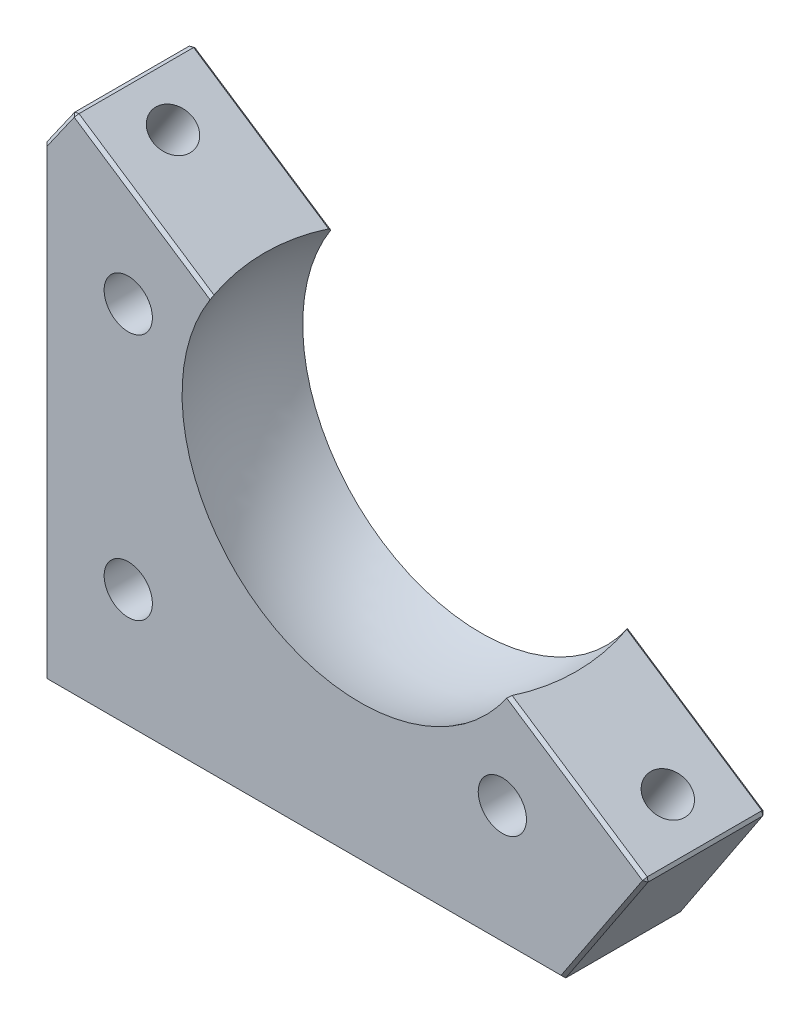
ISO-10303-21;
HEADER;
FILE_DESCRIPTION(('STEP AP214'),'2;1');
FILE_NAME('part.step','',(''),(''),'','','');
FILE_SCHEMA(('AUTOMOTIVE_DESIGN { 1 0 10303 214 1 1 1 1 }'));
ENDSEC;
DATA;
#1=APPLICATION_CONTEXT('core data for automotive mechanical design processes');
#2=APPLICATION_PROTOCOL_DEFINITION('international standard','automotive_design',2000,#1);
#3=PRODUCT_CONTEXT('',#1,'mechanical');
#4=PRODUCT('Part','Part','',(#3));
#5=PRODUCT_RELATED_PRODUCT_CATEGORY('part','',(#4));
#6=PRODUCT_DEFINITION_FORMATION('','',#4);
#7=PRODUCT_DEFINITION_CONTEXT('part definition',#1,'design');
#8=PRODUCT_DEFINITION('design','',#6,#7);
#9=PRODUCT_DEFINITION_SHAPE('','',#8);
#10=(LENGTH_UNIT() NAMED_UNIT(*) SI_UNIT(.MILLI.,.METRE.));
#11=(NAMED_UNIT(*) PLANE_ANGLE_UNIT() SI_UNIT($,.RADIAN.));
#12=(NAMED_UNIT(*) SI_UNIT($,.STERADIAN.) SOLID_ANGLE_UNIT());
#13=UNCERTAINTY_MEASURE_WITH_UNIT(LENGTH_MEASURE(1.E-05),#10,'distance_accuracy_value','');
#14=(GEOMETRIC_REPRESENTATION_CONTEXT(3) GLOBAL_UNCERTAINTY_ASSIGNED_CONTEXT((#13)) GLOBAL_UNIT_ASSIGNED_CONTEXT((#10,
#11,#12)) REPRESENTATION_CONTEXT('',''));
#15=CARTESIAN_POINT('',(0.,0.,0.));
#16=DIRECTION('',(0.,0.,1.));
#17=DIRECTION('',(1.,0.,0.));
#18=AXIS2_PLACEMENT_3D('',#15,#16,#17);
#19=CARTESIAN_POINT('',(4.91424723113366,84.,20.));
#20=DIRECTION('',(-0.552631578947369,-0.833425664321743,0.));
#21=DIRECTION('',(0.833425664321743,-0.552631578947369,0.));
#22=AXIS2_PLACEMENT_3D('',#19,#20,#21);
#23=PLANE('',#22);
#24=DIRECTION('',(0.,0.,1.));
#25=VECTOR('',#24,1.);
#26=CARTESIAN_POINT('',(5.33096006329454,83.7236842105263,20.));
#27=LINE('',#26,#25);
#28=CARTESIAN_POINT('',(5.33096006329454,83.7236842105263,0.5));
#29=VERTEX_POINT('',#28);
#30=CARTESIAN_POINT('',(5.33096006329454,83.7236842105263,19.5));
#31=VERTEX_POINT('',#30);
#32=EDGE_CURVE('E199',#29,#31,#27,.T.);
#33=ORIENTED_EDGE('',*,*,#32,.T.);
#34=DIRECTION('',(0.833425664321743,-0.552631578947369,0.));
#35=VECTOR('',#34,1.);
#36=CARTESIAN_POINT('',(27.8334529999816,68.8026315789474,19.5));
#37=LINE('',#36,#35);
#38=CARTESIAN_POINT('',(27.7090438574282,68.8851253439321,19.5));
#39=VERTEX_POINT('',#38);
#40=EDGE_CURVE('E206',#31,#39,#37,.T.);
#41=ORIENTED_EDGE('',*,*,#40,.T.);
#42=CARTESIAN_POINT('',(54.9892392291317,50.796052631579,10.));
#43=DIRECTION('',(-0.552631578947369,-0.833425664321743,0.));
#44=DIRECTION('',(0.833425664321743,-0.552631578947369,0.));
#45=AXIS2_PLACEMENT_3D('',#42,#43,#44);
#46=CIRCLE('',#45,34.0833333333333);
#47=CARTESIAN_POINT('',(27.7090438574282,68.8851253439321,0.499999999999993));
#48=VERTEX_POINT('',#47);
#49=EDGE_CURVE('E401',#48,#39,#46,.F.);
#50=ORIENTED_EDGE('',*,*,#49,.F.);
#51=DIRECTION('',(-0.833425664321743,0.552631578947369,0.));
#52=VECTOR('',#51,1.);
#53=CARTESIAN_POINT('',(4.91424723113366,84.,0.5));
#54=LINE('',#53,#52);
#55=EDGE_CURVE('E196',#48,#29,#54,.T.);
#56=ORIENTED_EDGE('',*,*,#55,.T.);
#57=EDGE_LOOP('',(#33,#41,#50,#56));
#58=FACE_BOUND('',#57,.T.);
#59=CARTESIAN_POINT('',(11.4149674128433,79.6894736842105,10.));
#60=DIRECTION('',(0.552631578947369,0.833425664321743,0.));
#61=DIRECTION('',(-0.833425664321743,0.552631578947369,0.));
#62=AXIS2_PLACEMENT_3D('',#59,#60,#61);
#63=CIRCLE('',#62,3.4);
#64=CARTESIAN_POINT('',(8.58132015414933,81.5684210526316,10.));
#65=VERTEX_POINT('',#64);
#66=EDGE_CURVE('E397',#65,#65,#63,.T.);
#67=ORIENTED_EDGE('',*,*,#66,.F.);
#68=EDGE_LOOP('',(#67));
#69=FACE_BOUND('',#68,.T.);
#70=ADVANCED_FACE('F48',(#58,#69),#23,.F.);
#71=CARTESIAN_POINT('',(77.0055671949644,36.1973684210526,20.));
#72=DIRECTION('',(-0.552631578947368,-0.833425664321743,0.));
#73=DIRECTION('',(0.833425664321743,-0.552631578947368,0.));
#74=AXIS2_PLACEMENT_3D('',#71,#72,#73);
#75=PLANE('',#74);
#76=CARTESIAN_POINT('',(93.4240527821027,25.3105263157894,10.));
#77=DIRECTION('',(0.552631578947368,0.833425664321743,0.));
#78=DIRECTION('',(-0.833425664321743,0.552631578947368,0.));
#79=AXIS2_PLACEMENT_3D('',#76,#77,#78);
#80=CIRCLE('',#79,3.39999999999999);
#81=CARTESIAN_POINT('',(90.5904055234088,27.1894736842105,10.));
#82=VERTEX_POINT('',#81);
#83=EDGE_CURVE('E391',#82,#82,#80,.T.);
#84=ORIENTED_EDGE('',*,*,#83,.F.);
#85=EDGE_LOOP('',(#84));
#86=FACE_BOUND('',#85,.T.);
#87=CARTESIAN_POINT('',(49.8497809658143,54.203947368421,10.));
#88=DIRECTION('',(-0.552631578947368,-0.833425664321743,0.));
#89=DIRECTION('',(0.833425664321743,-0.552631578947368,0.));
#90=AXIS2_PLACEMENT_3D('',#87,#88,#89);
#91=CIRCLE('',#90,34.0833333333333);
#92=CARTESIAN_POINT('',(77.1299763375178,36.1148746560679,19.5));
#93=VERTEX_POINT('',#92);
#94=CARTESIAN_POINT('',(77.1299763375178,36.1148746560679,0.500000000000013));
#95=VERTEX_POINT('',#94);
#96=EDGE_CURVE('E404',#93,#95,#91,.F.);
#97=ORIENTED_EDGE('',*,*,#96,.F.);
#98=DIRECTION('',(0.833425664321743,-0.552631578947368,0.));
#99=VECTOR('',#98,1.);
#100=CARTESIAN_POINT('',(99.9247729638123,21.,19.5));
#101=LINE('',#100,#99);
#102=CARTESIAN_POINT('',(99.5080601316515,21.2763157894737,19.5));
#103=VERTEX_POINT('',#102);
#104=EDGE_CURVE('E460',#93,#103,#101,.T.);
#105=ORIENTED_EDGE('',*,*,#104,.T.);
#106=DIRECTION('',(0.,0.,-1.));
#107=VECTOR('',#106,1.);
#108=CARTESIAN_POINT('',(99.5080601316515,21.2763157894737,20.));
#109=LINE('',#108,#107);
#110=CARTESIAN_POINT('',(99.5080601316515,21.2763157894737,0.5));
#111=VERTEX_POINT('',#110);
#112=EDGE_CURVE('E467',#103,#111,#109,.T.);
#113=ORIENTED_EDGE('',*,*,#112,.T.);
#114=DIRECTION('',(-0.833425664321743,0.552631578947368,0.));
#115=VECTOR('',#114,1.);
#116=CARTESIAN_POINT('',(77.0055671949644,36.1973684210526,0.5));
#117=LINE('',#116,#115);
#118=EDGE_CURVE('E466',#111,#95,#117,.T.);
#119=ORIENTED_EDGE('',*,*,#118,.T.);
#120=EDGE_LOOP('',(#97,#105,#113,#119));
#121=FACE_BOUND('',#120,.T.);
#122=ADVANCED_FACE('F252',(#86,#121),#75,.F.);
#123=CARTESIAN_POINT('',(86.,0.,20.));
#124=DIRECTION('',(0.,1.,0.));
#125=DIRECTION('',(-1.,0.,0.));
#126=AXIS2_PLACEMENT_3D('',#123,#124,#125);
#127=PLANE('',#126);
#128=CARTESIAN_POINT('',(76.6410369467711,0.,10.));
#129=DIRECTION('',(0.,1.,0.));
#130=DIRECTION('',(1.,0.,0.));
#131=AXIS2_PLACEMENT_3D('',#128,#129,#130);
#132=ELLIPSE('',#131,4.07954799756133,3.39999999999999);
#133=CARTESIAN_POINT('',(80.7205849443324,0.,10.));
#134=VERTEX_POINT('',#133);
#135=EDGE_CURVE('E396',#134,#134,#132,.T.);
#136=ORIENTED_EDGE('',*,*,#135,.T.);
#137=EDGE_LOOP('',(#136));
#138=FACE_BOUND('',#137,.T.);
#139=DIRECTION('',(0.,0.,-1.));
#140=VECTOR('',#139,1.);
#141=CARTESIAN_POINT('',(86.,0.,20.));
#142=LINE('',#141,#140);
#143=CARTESIAN_POINT('',(86.,0.,19.5));
#144=VERTEX_POINT('',#143);
#145=CARTESIAN_POINT('',(86.,0.,0.5));
#146=VERTEX_POINT('',#145);
#147=EDGE_CURVE('E179',#144,#146,#142,.T.);
#148=ORIENTED_EDGE('',*,*,#147,.F.);
#149=DIRECTION('',(-1.,0.,0.));
#150=VECTOR('',#149,1.);
#151=CARTESIAN_POINT('',(0.,0.,19.5));
#152=LINE('',#151,#150);
#153=CARTESIAN_POINT('',(0.5,0.,19.5));
#154=VERTEX_POINT('',#153);
#155=EDGE_CURVE('E481',#144,#154,#152,.T.);
#156=ORIENTED_EDGE('',*,*,#155,.T.);
#157=DIRECTION('',(0.,0.,-1.));
#158=VECTOR('',#157,1.);
#159=CARTESIAN_POINT('',(0.5,0.,20.));
#160=LINE('',#159,#158);
#161=CARTESIAN_POINT('',(0.5,0.,0.5));
#162=VERTEX_POINT('',#161);
#163=EDGE_CURVE('E479',#154,#162,#160,.T.);
#164=ORIENTED_EDGE('',*,*,#163,.T.);
#165=DIRECTION('',(1.,0.,0.));
#166=VECTOR('',#165,1.);
#167=CARTESIAN_POINT('',(86.,0.,0.5));
#168=LINE('',#167,#166);
#169=EDGE_CURVE('E477',#162,#146,#168,.T.);
#170=ORIENTED_EDGE('',*,*,#169,.T.);
#171=EDGE_LOOP('',(#148,#156,#164,#170));
#172=FACE_BOUND('',#171,.T.);
#173=ADVANCED_FACE('F258',(#138,#172),#127,.F.);
#174=CARTESIAN_POINT('',(99.9247729638123,21.,20.));
#175=DIRECTION('',(-0.833425664321742,0.552631578947369,0.));
#176=DIRECTION('',(-0.552631578947369,-0.833425664321742,0.));
#177=AXIS2_PLACEMENT_3D('',#174,#175,#176);
#178=PLANE('',#177);
#179=DIRECTION('',(0.,0.,1.));
#180=VECTOR('',#179,1.);
#181=CARTESIAN_POINT('',(99.6484571743387,20.5832871678391,20.));
#182=LINE('',#181,#180);
#183=CARTESIAN_POINT('',(99.6484571743387,20.5832871678391,0.5));
#184=VERTEX_POINT('',#183);
#185=CARTESIAN_POINT('',(99.6484571743387,20.5832871678391,19.5));
#186=VERTEX_POINT('',#185);
#187=EDGE_CURVE('E472',#184,#186,#182,.T.);
#188=ORIENTED_EDGE('',*,*,#187,.T.);
#189=DIRECTION('',(-0.552631578947369,-0.833425664321742,0.));
#190=VECTOR('',#189,1.);
#191=CARTESIAN_POINT('',(86.,0.,19.5));
#192=LINE('',#191,#190);
#193=EDGE_CURVE('E468',#186,#144,#192,.T.);
#194=ORIENTED_EDGE('',*,*,#193,.T.);
#195=ORIENTED_EDGE('',*,*,#147,.T.);
#196=DIRECTION('',(0.552631578947369,0.833425664321742,0.));
#197=VECTOR('',#196,1.);
#198=CARTESIAN_POINT('',(99.9247729638123,21.,0.5));
#199=LINE('',#198,#197);
#200=EDGE_CURVE('E523',#146,#184,#199,.T.);
#201=ORIENTED_EDGE('',*,*,#200,.T.);
#202=EDGE_LOOP('',(#188,#194,#195,#201));
#203=FACE_BOUND('',#202,.T.);
#204=ADVANCED_FACE('F265',(#203),#178,.F.);
#205=CARTESIAN_POINT('',(0.,77.,20.));
#206=DIRECTION('',(0.818448565329253,-0.574579799427798,0.));
#207=DIRECTION('',(0.574579799427798,0.818448565329253,0.));
#208=AXIS2_PLACEMENT_3D('',#205,#206,#207);
#209=PLANE('',#208);
#210=DIRECTION('',(0.,0.,-1.));
#211=VECTOR('',#210,1.);
#212=CARTESIAN_POINT('',(0.,77.,20.));
#213=LINE('',#212,#211);
#214=CARTESIAN_POINT('',(0.,77.,19.5));
#215=VERTEX_POINT('',#214);
#216=CARTESIAN_POINT('',(0.,77.,0.5));
#217=VERTEX_POINT('',#216);
#218=EDGE_CURVE('E167',#215,#217,#213,.T.);
#219=ORIENTED_EDGE('',*,*,#218,.F.);
#220=DIRECTION('',(0.574579799427798,0.818448565329253,0.));
#221=VECTOR('',#220,1.);
#222=CARTESIAN_POINT('',(4.91424723113366,84.,19.5));
#223=LINE('',#222,#221);
#224=CARTESIAN_POINT('',(4.61900891149117,83.5794537514506,19.5));
#225=VERTEX_POINT('',#224);
#226=EDGE_CURVE('E175',#215,#225,#223,.T.);
#227=ORIENTED_EDGE('',*,*,#226,.T.);
#228=DIRECTION('',(0.,0.,-1.));
#229=VECTOR('',#228,1.);
#230=CARTESIAN_POINT('',(4.61900891149117,83.5794537514506,20.));
#231=LINE('',#230,#229);
#232=CARTESIAN_POINT('',(4.61900891149117,83.5794537514506,0.5));
#233=VERTEX_POINT('',#232);
#234=EDGE_CURVE('E197',#225,#233,#231,.T.);
#235=ORIENTED_EDGE('',*,*,#234,.T.);
#236=DIRECTION('',(-0.574579799427798,-0.818448565329253,0.));
#237=VECTOR('',#236,1.);
#238=CARTESIAN_POINT('',(0.,77.,0.5));
#239=LINE('',#238,#237);
#240=EDGE_CURVE('E178',#233,#217,#239,.T.);
#241=ORIENTED_EDGE('',*,*,#240,.T.);
#242=EDGE_LOOP('',(#219,#227,#235,#241));
#243=FACE_BOUND('',#242,.T.);
#244=ADVANCED_FACE('F172',(#243),#209,.F.);
#245=CARTESIAN_POINT('',(0.,0.,20.));
#246=DIRECTION('',(1.,0.,0.));
#247=DIRECTION('',(0.,0.,-1.));
#248=AXIS2_PLACEMENT_3D('',#245,#246,#247);
#249=PLANE('',#248);
#250=CARTESIAN_POINT('',(0.,62.4745204284069,10.));
#251=DIRECTION('',(1.,0.,0.));
#252=DIRECTION('',(0.,1.,0.));
#253=AXIS2_PLACEMENT_3D('',#250,#251,#252);
#254=ELLIPSE('',#253,6.15238095238094,3.39999999999999);
#255=CARTESIAN_POINT('',(0.,68.6269013807878,10.));
#256=VERTEX_POINT('',#255);
#257=EDGE_CURVE('E400',#256,#256,#254,.T.);
#258=ORIENTED_EDGE('',*,*,#257,.T.);
#259=EDGE_LOOP('',(#258));
#260=FACE_BOUND('',#259,.T.);
#261=DIRECTION('',(0.,0.,1.));
#262=VECTOR('',#261,1.);
#263=CARTESIAN_POINT('',(0.,0.5,20.));
#264=LINE('',#263,#262);
#265=CARTESIAN_POINT('',(0.,0.5,0.5));
#266=VERTEX_POINT('',#265);
#267=CARTESIAN_POINT('',(0.,0.5,19.5));
#268=VERTEX_POINT('',#267);
#269=EDGE_CURVE('E58',#266,#268,#264,.T.);
#270=ORIENTED_EDGE('',*,*,#269,.T.);
#271=DIRECTION('',(0.,1.,0.));
#272=VECTOR('',#271,1.);
#273=CARTESIAN_POINT('',(0.,77.,19.5));
#274=LINE('',#273,#272);
#275=EDGE_CURVE('E13',#268,#215,#274,.T.);
#276=ORIENTED_EDGE('',*,*,#275,.T.);
#277=ORIENTED_EDGE('',*,*,#218,.T.);
#278=DIRECTION('',(0.,-1.,0.));
#279=VECTOR('',#278,1.);
#280=CARTESIAN_POINT('',(0.,0.,0.5));
#281=LINE('',#280,#279);
#282=EDGE_CURVE('E69',#217,#266,#281,.T.);
#283=ORIENTED_EDGE('',*,*,#282,.T.);
#284=EDGE_LOOP('',(#270,#276,#277,#283));
#285=FACE_BOUND('',#284,.T.);
#286=ADVANCED_FACE('F166',(#260,#285),#249,.F.);
#287=CARTESIAN_POINT('',(52.419510097473,52.5,20.));
#288=DIRECTION('',(0.,0.,1.));
#289=DIRECTION('',(1.,0.,0.));
#290=AXIS2_PLACEMENT_3D('',#287,#288,#289);
#291=PLANE('',#290);
#292=CARTESIAN_POINT('',(76.,20.,20.));
#293=DIRECTION('',(0.,0.,-1.));
#294=DIRECTION('',(-1.,0.,0.));
#295=AXIS2_PLACEMENT_3D('',#292,#293,#294);
#296=CIRCLE('',#295,4.00000000000001);
#297=CARTESIAN_POINT('',(72.,20.,20.));
#298=VERTEX_POINT('',#297);
#299=EDGE_CURVE('E374',#298,#298,#296,.T.);
#300=ORIENTED_EDGE('',*,*,#299,.T.);
#301=EDGE_LOOP('',(#300));
#302=FACE_BOUND('',#301,.T.);
#303=CARTESIAN_POINT('',(14.,20.,20.));
#304=DIRECTION('',(0.,0.,-1.));
#305=DIRECTION('',(-1.,0.,0.));
#306=AXIS2_PLACEMENT_3D('',#303,#304,#305);
#307=CIRCLE('',#306,4.);
#308=CARTESIAN_POINT('',(10.,20.,20.));
#309=VERTEX_POINT('',#308);
#310=EDGE_CURVE('E382',#309,#309,#307,.T.);
#311=ORIENTED_EDGE('',*,*,#310,.T.);
#312=EDGE_LOOP('',(#311));
#313=FACE_BOUND('',#312,.T.);
#314=CARTESIAN_POINT('',(14.,61.,20.));
#315=DIRECTION('',(0.,0.,-1.));
#316=DIRECTION('',(-1.,0.,0.));
#317=AXIS2_PLACEMENT_3D('',#314,#315,#316);
#318=CIRCLE('',#317,4.00000000000001);
#319=CARTESIAN_POINT('',(9.99999999999999,61.,20.));
#320=VERTEX_POINT('',#319);
#321=EDGE_CURVE('E388',#320,#320,#318,.T.);
#322=ORIENTED_EDGE('',*,*,#321,.T.);
#323=EDGE_LOOP('',(#322));
#324=FACE_BOUND('',#323,.T.);
#325=DIRECTION('',(0.552631578947369,0.833425664321742,0.));
#326=VECTOR('',#325,1.);
#327=CARTESIAN_POINT('',(99.5080601316515,21.2763157894737,20.));
#328=LINE('',#327,#326);
#329=CARTESIAN_POINT('',(85.731608684371,0.5,20.));
#330=VERTEX_POINT('',#329);
#331=CARTESIAN_POINT('',(99.2317443421778,20.8596029573128,20.));
#332=VERTEX_POINT('',#331);
#333=EDGE_CURVE('E211',#330,#332,#328,.T.);
#334=ORIENTED_EDGE('',*,*,#333,.T.);
#335=DIRECTION('',(-0.833425664321743,0.552631578947368,0.));
#336=VECTOR('',#335,1.);
#337=CARTESIAN_POINT('',(76.7292514054908,35.7806555888917,20.));
#338=LINE('',#337,#336);
#339=CARTESIAN_POINT('',(76.7257196871507,35.782997416323,20.));
#340=VERTEX_POINT('',#339);
#341=EDGE_CURVE('E217',#332,#340,#338,.T.);
#342=ORIENTED_EDGE('',*,*,#341,.T.);
#343=CARTESIAN_POINT('',(52.419510097473,52.5,20.));
#344=DIRECTION('',(0.,0.,-1.));
#345=DIRECTION('',(1.,0.,0.));
#346=AXIS2_PLACEMENT_3D('',#343,#344,#345);
#347=CIRCLE('',#346,29.5);
#348=CARTESIAN_POINT('',(27.560668928848,68.3835769193552,20.));
#349=VERTEX_POINT('',#348);
#350=EDGE_CURVE('E180',#340,#349,#347,.T.);
#351=ORIENTED_EDGE('',*,*,#350,.T.);
#352=DIRECTION('',(-0.833425664321743,0.552631578947369,0.));
#353=VECTOR('',#352,1.);
#354=CARTESIAN_POINT('',(4.63793144165997,83.5832871678391,20.));
#355=LINE('',#354,#353);
#356=CARTESIAN_POINT('',(5.04371586846152,83.3142178337695,20.));
#357=VERTEX_POINT('',#356);
#358=EDGE_CURVE('E215',#349,#357,#355,.T.);
#359=ORIENTED_EDGE('',*,*,#358,.T.);
#360=DIRECTION('',(-0.574579799427798,-0.818448565329253,0.));
#361=VECTOR('',#360,1.);
#362=CARTESIAN_POINT('',(0.409224282664626,76.7127101002861,20.));
#363=LINE('',#362,#361);
#364=CARTESIAN_POINT('',(0.5,76.8420137334696,20.));
#365=VERTEX_POINT('',#364);
#366=EDGE_CURVE('E213',#357,#365,#363,.T.);
#367=ORIENTED_EDGE('',*,*,#366,.T.);
#368=DIRECTION('',(0.,-1.,0.));
#369=VECTOR('',#368,1.);
#370=CARTESIAN_POINT('',(0.5,0.,20.));
#371=LINE('',#370,#369);
#372=CARTESIAN_POINT('',(0.5,0.500000000000001,20.));
#373=VERTEX_POINT('',#372);
#374=EDGE_CURVE('E186',#365,#373,#371,.T.);
#375=ORIENTED_EDGE('',*,*,#374,.T.);
#376=DIRECTION('',(1.,0.,0.));
#377=VECTOR('',#376,1.);
#378=CARTESIAN_POINT('',(86.,0.5,20.));
#379=LINE('',#378,#377);
#380=EDGE_CURVE('E209',#373,#330,#379,.T.);
#381=ORIENTED_EDGE('',*,*,#380,.T.);
#382=EDGE_LOOP('',(#334,#342,#351,#359,#367,#375,#381));
#383=FACE_BOUND('',#382,.T.);
#384=ADVANCED_FACE('F444',(#302,#313,#324,#383),#291,.T.);
#385=CARTESIAN_POINT('',(52.419510097473,52.5,0.));
#386=DIRECTION('',(0.,0.,1.));
#387=DIRECTION('',(1.,0.,0.));
#388=AXIS2_PLACEMENT_3D('',#385,#386,#387);
#389=PLANE('',#388);
#390=CARTESIAN_POINT('',(76.,20.,0.));
#391=DIRECTION('',(0.,0.,-1.));
#392=DIRECTION('',(-1.,0.,0.));
#393=AXIS2_PLACEMENT_3D('',#390,#391,#392);
#394=CIRCLE('',#393,4.00000000000001);
#395=CARTESIAN_POINT('',(72.,20.,0.));
#396=VERTEX_POINT('',#395);
#397=EDGE_CURVE('E371',#396,#396,#394,.T.);
#398=ORIENTED_EDGE('',*,*,#397,.F.);
#399=EDGE_LOOP('',(#398));
#400=FACE_BOUND('',#399,.T.);
#401=CARTESIAN_POINT('',(14.,20.,0.));
#402=DIRECTION('',(0.,0.,-1.));
#403=DIRECTION('',(-1.,0.,0.));
#404=AXIS2_PLACEMENT_3D('',#401,#402,#403);
#405=CIRCLE('',#404,4.);
#406=CARTESIAN_POINT('',(10.,20.,0.));
#407=VERTEX_POINT('',#406);
#408=EDGE_CURVE('E379',#407,#407,#405,.T.);
#409=ORIENTED_EDGE('',*,*,#408,.F.);
#410=EDGE_LOOP('',(#409));
#411=FACE_BOUND('',#410,.T.);
#412=CARTESIAN_POINT('',(14.,61.,0.));
#413=DIRECTION('',(0.,0.,-1.));
#414=DIRECTION('',(-1.,0.,0.));
#415=AXIS2_PLACEMENT_3D('',#412,#413,#414);
#416=CIRCLE('',#415,4.00000000000001);
#417=CARTESIAN_POINT('',(9.99999999999999,61.,0.));
#418=VERTEX_POINT('',#417);
#419=EDGE_CURVE('E385',#418,#418,#416,.T.);
#420=ORIENTED_EDGE('',*,*,#419,.F.);
#421=EDGE_LOOP('',(#420));
#422=FACE_BOUND('',#421,.T.);
#423=DIRECTION('',(0.574579799427798,0.818448565329253,0.));
#424=VECTOR('',#423,1.);
#425=CARTESIAN_POINT('',(6.19363504345201,84.9521969272789,0.));
#426=LINE('',#425,#424);
#427=CARTESIAN_POINT('',(0.5,76.8420137334696,0.));
#428=VERTEX_POINT('',#427);
#429=CARTESIAN_POINT('',(5.04371586846152,83.3142178337695,0.));
#430=VERTEX_POINT('',#429);
#431=EDGE_CURVE('E530',#428,#430,#426,.T.);
#432=ORIENTED_EDGE('',*,*,#431,.T.);
#433=DIRECTION('',(0.833425664321743,-0.552631578947369,0.));
#434=VECTOR('',#433,1.);
#435=CARTESIAN_POINT('',(52.1431943079993,52.0832871678391,0.));
#436=LINE('',#435,#434);
#437=CARTESIAN_POINT('',(27.560668928848,68.3835769193552,0.));
#438=VERTEX_POINT('',#437);
#439=EDGE_CURVE('E534',#430,#438,#436,.T.);
#440=ORIENTED_EDGE('',*,*,#439,.T.);
#441=CARTESIAN_POINT('',(52.419510097473,52.5,0.));
#442=DIRECTION('',(0.,0.,-1.));
#443=DIRECTION('',(1.,0.,0.));
#444=AXIS2_PLACEMENT_3D('',#441,#442,#443);
#445=CIRCLE('',#444,29.5);
#446=CARTESIAN_POINT('',(76.7257196871507,35.782997416323,0.));
#447=VERTEX_POINT('',#446);
#448=EDGE_CURVE('E407',#447,#438,#445,.T.);
#449=ORIENTED_EDGE('',*,*,#448,.F.);
#450=DIRECTION('',(0.833425664321743,-0.552631578947368,0.));
#451=VECTOR('',#450,1.);
#452=CARTESIAN_POINT('',(52.1431943079993,52.0832871678391,0.));
#453=LINE('',#452,#451);
#454=CARTESIAN_POINT('',(99.2317443421778,20.8596029573128,0.));
#455=VERTEX_POINT('',#454);
#456=EDGE_CURVE('E527',#447,#455,#453,.T.);
#457=ORIENTED_EDGE('',*,*,#456,.T.);
#458=DIRECTION('',(-0.552631578947369,-0.833425664321742,0.));
#459=VECTOR('',#458,1.);
#460=CARTESIAN_POINT('',(99.5080601316514,21.2763157894736,0.));
#461=LINE('',#460,#459);
#462=CARTESIAN_POINT('',(85.731608684371,0.5,0.));
#463=VERTEX_POINT('',#462);
#464=EDGE_CURVE('E524',#455,#463,#461,.T.);
#465=ORIENTED_EDGE('',*,*,#464,.T.);
#466=DIRECTION('',(-1.,0.,0.));
#467=VECTOR('',#466,1.);
#468=CARTESIAN_POINT('',(52.419510097473,0.5,0.));
#469=LINE('',#468,#467);
#470=CARTESIAN_POINT('',(0.5,0.500000000000001,0.));
#471=VERTEX_POINT('',#470);
#472=EDGE_CURVE('E302',#463,#471,#469,.T.);
#473=ORIENTED_EDGE('',*,*,#472,.T.);
#474=DIRECTION('',(0.,1.,0.));
#475=VECTOR('',#474,1.);
#476=CARTESIAN_POINT('',(0.5,52.5,0.));
#477=LINE('',#476,#475);
#478=EDGE_CURVE('E528',#471,#428,#477,.T.);
#479=ORIENTED_EDGE('',*,*,#478,.T.);
#480=EDGE_LOOP('',(#432,#440,#449,#457,#465,#473,#479));
#481=FACE_BOUND('',#480,.T.);
#482=ADVANCED_FACE('F447',(#400,#411,#422,#481),#389,.F.);
#483=CARTESIAN_POINT('',(52.419510097473,52.5,10.));
#484=DIRECTION('',(0.,0.,1.));
#485=DIRECTION('',(1.,0.,0.));
#486=AXIS2_PLACEMENT_3D('',#483,#484,#485);
#487=DEGENERATE_TOROIDAL_SURFACE('',#486,3.0833333333333,34.0833333333333,.F.);
#488=ORIENTED_EDGE('',*,*,#49,.T.);
#489=CARTESIAN_POINT('',(27.7090438574282,68.8851253439321,19.5));
#490=CARTESIAN_POINT('',(27.6830844702675,68.8021029158386,19.5835389994025));
#491=CARTESIAN_POINT('',(27.6577401993511,68.7187959999073,19.6669751656089));
#492=CARTESIAN_POINT('',(27.6082818898148,68.5516131917194,19.8336418322772));
#493=CARTESIAN_POINT('',(27.5841678512044,68.4677372994585,19.9168723327374));
#494=CARTESIAN_POINT('',(27.560668928848,68.3835769193552,20.));
#495=B_SPLINE_CURVE_WITH_KNOTS('',3,(#489,#490,#491,#492,#493,#494),.UNSPECIFIED.,.F.,.F.,(4,2,
4),(0.,0.361795126105144,0.723590255021879),.UNSPECIFIED.);
#496=EDGE_CURVE('E296',#39,#349,#495,.T.);
#497=ORIENTED_EDGE('',*,*,#496,.T.);
#498=ORIENTED_EDGE('',*,*,#350,.F.);
#499=CARTESIAN_POINT('',(76.7257196871507,35.782997416323,20.));
#500=CARTESIAN_POINT('',(76.7940987128212,35.8373984988434,19.9168723327375));
#501=CARTESIAN_POINT('',(76.8619762799827,35.8922554768582,19.8336418322772));
#502=CARTESIAN_POINT('',(76.996728496764,36.0028812234469,19.6669751656089));
#503=CARTESIAN_POINT('',(77.0636031463915,36.0586499920137,19.5835389994025));
#504=CARTESIAN_POINT('',(77.1299763375178,36.1148746560679,19.5));
#505=B_SPLINE_CURVE_WITH_KNOTS('',3,(#499,#500,#501,#502,#503,#504),.UNSPECIFIED.,.F.,.F.,(4,2,
4),(0.,0.361795128916739,0.723590255021882),.UNSPECIFIED.);
#506=EDGE_CURVE('E226',#340,#93,#505,.T.);
#507=ORIENTED_EDGE('',*,*,#506,.T.);
#508=ORIENTED_EDGE('',*,*,#96,.T.);
#509=CARTESIAN_POINT('',(77.1299763375178,36.1148746560679,0.5));
#510=CARTESIAN_POINT('',(77.0636031463915,36.0586499920137,0.416461000597479));
#511=CARTESIAN_POINT('',(76.996728496764,36.0028812234469,0.333024834391053));
#512=CARTESIAN_POINT('',(76.8619762799827,35.8922554768582,0.166358167722787));
#513=CARTESIAN_POINT('',(76.7940987128212,35.8373984988434,0.0831276672625459));
#514=CARTESIAN_POINT('',(76.7257196871507,35.782997416323,0.));
#515=B_SPLINE_CURVE_WITH_KNOTS('',3,(#509,#510,#511,#512,#513,#514),.UNSPECIFIED.,.F.,.F.,(4,2,
4),(0.,0.361795126105141,0.723590255021883),.UNSPECIFIED.);
#516=EDGE_CURVE('E219',#95,#447,#515,.T.);
#517=ORIENTED_EDGE('',*,*,#516,.T.);
#518=ORIENTED_EDGE('',*,*,#448,.T.);
#519=CARTESIAN_POINT('',(27.560668928848,68.3835769193552,0.));
#520=CARTESIAN_POINT('',(27.5841678512044,68.4677372994585,0.0831276672625502));
#521=CARTESIAN_POINT('',(27.6082818898148,68.5516131917194,0.166358167722792));
#522=CARTESIAN_POINT('',(27.6577401993511,68.7187959999073,0.333024834391058));
#523=CARTESIAN_POINT('',(27.6830844702675,68.8021029158386,0.416461000597482));
#524=CARTESIAN_POINT('',(27.7090438574282,68.8851253439321,0.500000000000001));
#525=B_SPLINE_CURVE_WITH_KNOTS('',3,(#519,#520,#521,#522,#523,#524),.UNSPECIFIED.,.F.,.F.,(4,2,
4),(0.,0.361795128916739,0.723590255021882),.UNSPECIFIED.);
#526=EDGE_CURVE('E291',#438,#48,#525,.T.);
#527=ORIENTED_EDGE('',*,*,#526,.T.);
#528=EDGE_LOOP('',(#488,#497,#498,#507,#508,#517,#518,#527));
#529=FACE_BOUND('',#528,.T.);
#530=ADVANCED_FACE('F231',(#529),#487,.T.);
#531=CARTESIAN_POINT('',(11.4149674128433,79.6894736842105,10.));
#532=DIRECTION('',(0.552631578947369,0.833425664321743,0.));
#533=DIRECTION('',(-0.833425664321743,0.552631578947369,0.));
#534=AXIS2_PLACEMENT_3D('',#531,#532,#533);
#535=CYLINDRICAL_SURFACE('',#534,3.39999999999999);
#536=ORIENTED_EDGE('',*,*,#66,.T.);
#537=EDGE_LOOP('',(#536));
#538=FACE_BOUND('',#537,.T.);
#539=ORIENTED_EDGE('',*,*,#257,.F.);
#540=EDGE_LOOP('',(#539));
#541=FACE_BOUND('',#540,.T.);
#542=ADVANCED_FACE('F423',(#538,#541),#535,.F.);
#543=CARTESIAN_POINT('',(93.4240527821027,25.3105263157894,10.));
#544=DIRECTION('',(0.552631578947368,0.833425664321743,0.));
#545=DIRECTION('',(-0.833425664321743,0.552631578947368,0.));
#546=AXIS2_PLACEMENT_3D('',#543,#544,#545);
#547=CYLINDRICAL_SURFACE('',#546,3.39999999999999);
#548=ORIENTED_EDGE('',*,*,#83,.T.);
#549=EDGE_LOOP('',(#548));
#550=FACE_BOUND('',#549,.T.);
#551=ORIENTED_EDGE('',*,*,#135,.F.);
#552=EDGE_LOOP('',(#551));
#553=FACE_BOUND('',#552,.T.);
#554=ADVANCED_FACE('F420',(#550,#553),#547,.F.);
#555=CARTESIAN_POINT('',(14.,61.,20.));
#556=DIRECTION('',(0.,0.,-1.));
#557=DIRECTION('',(-1.,0.,0.));
#558=AXIS2_PLACEMENT_3D('',#555,#556,#557);
#559=CYLINDRICAL_SURFACE('',#558,4.00000000000001);
#560=ORIENTED_EDGE('',*,*,#321,.F.);
#561=EDGE_LOOP('',(#560));
#562=FACE_BOUND('',#561,.T.);
#563=ORIENTED_EDGE('',*,*,#419,.T.);
#564=EDGE_LOOP('',(#563));
#565=FACE_BOUND('',#564,.T.);
#566=ADVANCED_FACE('F422',(#562,#565),#559,.F.);
#567=CARTESIAN_POINT('',(14.,20.,20.));
#568=DIRECTION('',(0.,0.,-1.));
#569=DIRECTION('',(-1.,0.,0.));
#570=AXIS2_PLACEMENT_3D('',#567,#568,#569);
#571=CYLINDRICAL_SURFACE('',#570,4.);
#572=ORIENTED_EDGE('',*,*,#310,.F.);
#573=EDGE_LOOP('',(#572));
#574=FACE_BOUND('',#573,.T.);
#575=ORIENTED_EDGE('',*,*,#408,.T.);
#576=EDGE_LOOP('',(#575));
#577=FACE_BOUND('',#576,.T.);
#578=ADVANCED_FACE('F430',(#574,#577),#571,.F.);
#579=CARTESIAN_POINT('',(76.,20.,20.));
#580=DIRECTION('',(0.,0.,-1.));
#581=DIRECTION('',(-1.,0.,0.));
#582=AXIS2_PLACEMENT_3D('',#579,#580,#581);
#583=CYLINDRICAL_SURFACE('',#582,4.00000000000001);
#584=ORIENTED_EDGE('',*,*,#299,.F.);
#585=EDGE_LOOP('',(#584));
#586=FACE_BOUND('',#585,.T.);
#587=ORIENTED_EDGE('',*,*,#397,.T.);
#588=EDGE_LOOP('',(#587));
#589=FACE_BOUND('',#588,.T.);
#590=ADVANCED_FACE('F248',(#586,#589),#583,.F.);
#591=CARTESIAN_POINT('',(52.1431943079993,52.0832871678391,20.));
#592=DIRECTION('',(0.390769536971516,0.589320938856812,0.707106781186542));
#593=DIRECTION('',(0.833425664321743,-0.552631578947368,0.));
#594=AXIS2_PLACEMENT_3D('',#591,#592,#593);
#595=PLANE('',#594);
#596=ORIENTED_EDGE('',*,*,#506,.F.);
#597=ORIENTED_EDGE('',*,*,#341,.F.);
#598=DIRECTION('',(-0.390769536971514,-0.589320938856801,0.707106781186552));
#599=VECTOR('',#598,1.);
#600=CARTESIAN_POINT('',(99.2317443421778,20.8596029573128,20.));
#601=LINE('',#600,#599);
#602=EDGE_CURVE('E53',#103,#332,#601,.T.);
#603=ORIENTED_EDGE('',*,*,#602,.F.);
#604=ORIENTED_EDGE('',*,*,#104,.F.);
#605=EDGE_LOOP('',(#596,#597,#603,#604));
#606=FACE_BOUND('',#605,.T.);
#607=ADVANCED_FACE('F50',(#606),#595,.T.);
#608=CARTESIAN_POINT('',(99.5080601316515,21.2763157894737,20.));
#609=DIRECTION('',(-0.98009047582832,-0.198551401885297,0.));
#610=DIRECTION('',(0.,0.,-1.));
#611=AXIS2_PLACEMENT_3D('',#608,#609,#610);
#612=PLANE('',#611);
#613=DIRECTION('',(-0.198551401885297,0.98009047582832,0.));
#614=VECTOR('',#613,1.);
#615=CARTESIAN_POINT('',(99.5080601316515,21.2763157894737,0.5));
#616=LINE('',#615,#614);
#617=EDGE_CURVE('E354',#111,#184,#616,.F.);
#618=ORIENTED_EDGE('',*,*,#617,.F.);
#619=ORIENTED_EDGE('',*,*,#112,.F.);
#620=DIRECTION('',(0.198551401885297,-0.98009047582832,0.));
#621=VECTOR('',#620,1.);
#622=CARTESIAN_POINT('',(99.5782586529951,20.9298014786564,19.5));
#623=LINE('',#622,#621);
#624=EDGE_CURVE('E362',#186,#103,#623,.F.);
#625=ORIENTED_EDGE('',*,*,#624,.F.);
#626=ORIENTED_EDGE('',*,*,#187,.F.);
#627=EDGE_LOOP('',(#618,#619,#625,#626));
#628=FACE_BOUND('',#627,.T.);
#629=ADVANCED_FACE('F240',(#628),#612,.F.);
#630=CARTESIAN_POINT('',(77.0055671949644,36.1973684210526,0.5));
#631=DIRECTION('',(-0.390769536971516,-0.589320938856812,0.707106781186542));
#632=DIRECTION('',(-0.833425664321743,0.552631578947368,0.));
#633=AXIS2_PLACEMENT_3D('',#630,#631,#632);
#634=PLANE('',#633);
#635=ORIENTED_EDGE('',*,*,#516,.F.);
#636=ORIENTED_EDGE('',*,*,#118,.F.);
#637=DIRECTION('',(-0.390769536971509,-0.589320938856804,-0.707106781186553));
#638=VECTOR('',#637,1.);
#639=CARTESIAN_POINT('',(99.5080601316515,21.2763157894737,0.499999999999999));
#640=LINE('',#639,#638);
#641=EDGE_CURVE('E353',#455,#111,#640,.F.);
#642=ORIENTED_EDGE('',*,*,#641,.F.);
#643=ORIENTED_EDGE('',*,*,#456,.F.);
#644=EDGE_LOOP('',(#635,#636,#642,#643));
#645=FACE_BOUND('',#644,.T.);
#646=ADVANCED_FACE('F235',(#645),#634,.F.);
#647=CARTESIAN_POINT('',(99.2317443421778,20.8596029573128,20.));
#648=DIRECTION('',(0.800240522513656,0.162116540777747,0.577350269189621));
#649=DIRECTION('',(0.585090063726162,0.,-0.810968320792443));
#650=AXIS2_PLACEMENT_3D('',#647,#648,#649);
#651=PLANE('',#650);
#652=ORIENTED_EDGE('',*,*,#624,.T.);
#653=ORIENTED_EDGE('',*,*,#602,.T.);
#654=DIRECTION('',(0.589320938856803,-0.390769536971514,-0.707106781186552));
#655=VECTOR('',#654,1.);
#656=CARTESIAN_POINT('',(99.2317443421778,20.8596029573128,20.));
#657=LINE('',#656,#655);
#658=EDGE_CURVE('E360',#186,#332,#657,.F.);
#659=ORIENTED_EDGE('',*,*,#658,.F.);
#660=EDGE_LOOP('',(#652,#653,#659));
#661=FACE_BOUND('',#660,.T.);
#662=ADVANCED_FACE('F239',(#661),#651,.T.);
#663=CARTESIAN_POINT('',(99.5080601316515,21.2763157894737,0.5));
#664=DIRECTION('',(0.800240522513655,0.162116540777753,-0.577350269189621));
#665=DIRECTION('',(-0.585090063726162,0.,-0.810968320792444));
#666=AXIS2_PLACEMENT_3D('',#663,#664,#665);
#667=PLANE('',#666);
#668=ORIENTED_EDGE('',*,*,#641,.T.);
#669=ORIENTED_EDGE('',*,*,#617,.T.);
#670=DIRECTION('',(0.589320938856804,-0.39076953697151,0.707106781186552));
#671=VECTOR('',#670,1.);
#672=CARTESIAN_POINT('',(99.4401007582582,20.721445062576,0.250000000000003));
#673=LINE('',#672,#671);
#674=EDGE_CURVE('E356',#455,#184,#673,.T.);
#675=ORIENTED_EDGE('',*,*,#674,.F.);
#676=EDGE_LOOP('',(#668,#669,#675));
#677=FACE_BOUND('',#676,.T.);
#678=ADVANCED_FACE('F341',(#677),#667,.T.);
#679=CARTESIAN_POINT('',(99.5080601316514,21.2763157894736,20.));
#680=DIRECTION('',(0.589320938856811,-0.390769536971516,0.707106781186543));
#681=DIRECTION('',(-0.552631578947369,-0.833425664321742,0.));
#682=AXIS2_PLACEMENT_3D('',#679,#680,#681);
#683=PLANE('',#682);
#684=ORIENTED_EDGE('',*,*,#658,.T.);
#685=ORIENTED_EDGE('',*,*,#333,.F.);
#686=DIRECTION('',(-0.354860431614909,0.661087768028604,0.661087768028603));
#687=VECTOR('',#686,1.);
#688=CARTESIAN_POINT('',(81.5367518252803,8.31481481481464,27.8148148148146));
#689=LINE('',#688,#687);
#690=EDGE_CURVE('E520',#144,#330,#689,.T.);
#691=ORIENTED_EDGE('',*,*,#690,.F.);
#692=ORIENTED_EDGE('',*,*,#193,.F.);
#693=EDGE_LOOP('',(#684,#685,#691,#692));
#694=FACE_BOUND('',#693,.T.);
#695=ADVANCED_FACE('F338',(#694),#683,.T.);
#696=CARTESIAN_POINT('',(99.9247729638123,21.,0.5));
#697=DIRECTION('',(-0.589320938856811,0.390769536971516,0.707106781186543));
#698=DIRECTION('',(0.552631578947369,0.833425664321742,0.));
#699=AXIS2_PLACEMENT_3D('',#696,#697,#698);
#700=PLANE('',#699);
#701=ORIENTED_EDGE('',*,*,#674,.T.);
#702=ORIENTED_EDGE('',*,*,#200,.F.);
#703=DIRECTION('',(0.354860431614909,-0.661087768028604,0.661087768028603));
#704=VECTOR('',#703,1.);
#705=CARTESIAN_POINT('',(86.,0.,0.500000000000001));
#706=LINE('',#705,#704);
#707=EDGE_CURVE('E517',#463,#146,#706,.T.);
#708=ORIENTED_EDGE('',*,*,#707,.F.);
#709=ORIENTED_EDGE('',*,*,#464,.F.);
#710=EDGE_LOOP('',(#701,#702,#708,#709));
#711=FACE_BOUND('',#710,.T.);
#712=ADVANCED_FACE('F334',(#711),#700,.F.);
#713=CARTESIAN_POINT('',(52.419510097473,0.5,20.));
#714=DIRECTION('',(0.,-0.707106781186547,0.707106781186548));
#715=DIRECTION('',(-1.,0.,0.));
#716=AXIS2_PLACEMENT_3D('',#713,#714,#715);
#717=PLANE('',#716);
#718=ORIENTED_EDGE('',*,*,#690,.T.);
#719=ORIENTED_EDGE('',*,*,#380,.F.);
#720=DIRECTION('',(0.,0.707106781186548,0.707106781186547));
#721=VECTOR('',#720,1.);
#722=CARTESIAN_POINT('',(0.500000000000001,0.,19.5));
#723=LINE('',#722,#721);
#724=EDGE_CURVE('E514',#154,#373,#723,.T.);
#725=ORIENTED_EDGE('',*,*,#724,.F.);
#726=ORIENTED_EDGE('',*,*,#155,.F.);
#727=EDGE_LOOP('',(#718,#719,#725,#726));
#728=FACE_BOUND('',#727,.T.);
#729=ADVANCED_FACE('F330',(#728),#717,.T.);
#730=CARTESIAN_POINT('',(0.5,0.,20.));
#731=DIRECTION('',(0.707106781186547,0.707106781186547,0.));
#732=DIRECTION('',(0.,0.,-1.));
#733=AXIS2_PLACEMENT_3D('',#730,#731,#732);
#734=PLANE('',#733);
#735=DIRECTION('',(0.707106781186548,-0.707106781186548,0.));
#736=VECTOR('',#735,1.);
#737=CARTESIAN_POINT('',(0.5,0.,0.5));
#738=LINE('',#737,#736);
#739=EDGE_CURVE('E508',#162,#266,#738,.F.);
#740=ORIENTED_EDGE('',*,*,#739,.F.);
#741=ORIENTED_EDGE('',*,*,#163,.F.);
#742=DIRECTION('',(-0.707106781186548,0.707106781186548,0.));
#743=VECTOR('',#742,1.);
#744=CARTESIAN_POINT('',(0.5,0.,19.5));
#745=LINE('',#744,#743);
#746=EDGE_CURVE('E511',#268,#154,#745,.F.);
#747=ORIENTED_EDGE('',*,*,#746,.F.);
#748=ORIENTED_EDGE('',*,*,#269,.F.);
#749=EDGE_LOOP('',(#740,#741,#747,#748));
#750=FACE_BOUND('',#749,.T.);
#751=ADVANCED_FACE('F326',(#750),#734,.F.);
#752=CARTESIAN_POINT('',(86.,0.,0.5));
#753=DIRECTION('',(0.,0.707106781186547,0.707106781186548));
#754=DIRECTION('',(1.,0.,0.));
#755=AXIS2_PLACEMENT_3D('',#752,#753,#754);
#756=PLANE('',#755);
#757=ORIENTED_EDGE('',*,*,#707,.T.);
#758=ORIENTED_EDGE('',*,*,#169,.F.);
#759=DIRECTION('',(0.,0.707106781186548,-0.707106781186547));
#760=VECTOR('',#759,1.);
#761=CARTESIAN_POINT('',(0.5,0.,0.5));
#762=LINE('',#761,#760);
#763=EDGE_CURVE('E505',#471,#162,#762,.F.);
#764=ORIENTED_EDGE('',*,*,#763,.F.);
#765=ORIENTED_EDGE('',*,*,#472,.F.);
#766=EDGE_LOOP('',(#757,#758,#764,#765));
#767=FACE_BOUND('',#766,.T.);
#768=ADVANCED_FACE('F322',(#767),#756,.F.);
#769=CARTESIAN_POINT('',(0.5,0.,19.5));
#770=DIRECTION('',(-0.577350269189626,-0.577350269189626,0.577350269189626));
#771=DIRECTION('',(0.707106781186548,0.,0.707106781186547));
#772=AXIS2_PLACEMENT_3D('',#769,#770,#771);
#773=PLANE('',#772);
#774=ORIENTED_EDGE('',*,*,#746,.T.);
#775=ORIENTED_EDGE('',*,*,#724,.T.);
#776=DIRECTION('',(-0.707106781186547,0.,-0.707106781186547));
#777=VECTOR('',#776,1.);
#778=CARTESIAN_POINT('',(0.25,0.500000000000001,19.75));
#779=LINE('',#778,#777);
#780=EDGE_CURVE('E503',#268,#373,#779,.F.);
#781=ORIENTED_EDGE('',*,*,#780,.F.);
#782=EDGE_LOOP('',(#774,#775,#781));
#783=FACE_BOUND('',#782,.T.);
#784=ADVANCED_FACE('F318',(#783),#773,.T.);
#785=CARTESIAN_POINT('',(0.5,0.,0.5));
#786=DIRECTION('',(-0.577350269189626,-0.577350269189626,-0.577350269189626));
#787=DIRECTION('',(-0.707106781186548,0.,0.707106781186547));
#788=AXIS2_PLACEMENT_3D('',#785,#786,#787);
#789=PLANE('',#788);
#790=ORIENTED_EDGE('',*,*,#763,.T.);
#791=ORIENTED_EDGE('',*,*,#739,.T.);
#792=DIRECTION('',(-0.707106781186547,0.,0.707106781186547));
#793=VECTOR('',#792,1.);
#794=CARTESIAN_POINT('',(0.25,0.500000000000001,0.250000000000001));
#795=LINE('',#794,#793);
#796=EDGE_CURVE('E189',#471,#266,#795,.T.);
#797=ORIENTED_EDGE('',*,*,#796,.F.);
#798=EDGE_LOOP('',(#790,#791,#797));
#799=FACE_BOUND('',#798,.T.);
#800=ADVANCED_FACE('F315',(#799),#789,.T.);
#801=CARTESIAN_POINT('',(0.5,52.5,20.));
#802=DIRECTION('',(-0.707106781186547,0.,0.707106781186547));
#803=DIRECTION('',(0.,1.,0.));
#804=AXIS2_PLACEMENT_3D('',#801,#802,#803);
#805=PLANE('',#804);
#806=ORIENTED_EDGE('',*,*,#780,.T.);
#807=ORIENTED_EDGE('',*,*,#374,.F.);
#808=DIRECTION('',(-0.690092072260929,0.218050140117434,-0.690092072260929));
#809=VECTOR('',#808,1.);
#810=CARTESIAN_POINT('',(4.16285655793282,75.6846516686214,23.6628565579328));
#811=LINE('',#810,#809);
#812=EDGE_CURVE('E184',#215,#365,#811,.F.);
#813=ORIENTED_EDGE('',*,*,#812,.F.);
#814=ORIENTED_EDGE('',*,*,#275,.F.);
#815=EDGE_LOOP('',(#806,#807,#813,#814));
#816=FACE_BOUND('',#815,.T.);
#817=ADVANCED_FACE('F185',(#816),#805,.T.);
#818=CARTESIAN_POINT('',(0.,0.,0.5));
#819=DIRECTION('',(0.707106781186547,0.,0.707106781186547));
#820=DIRECTION('',(0.,-1.,0.));
#821=AXIS2_PLACEMENT_3D('',#818,#819,#820);
#822=PLANE('',#821);
#823=ORIENTED_EDGE('',*,*,#796,.T.);
#824=ORIENTED_EDGE('',*,*,#282,.F.);
#825=DIRECTION('',(0.690092072260929,-0.218050140117434,-0.690092072260929));
#826=VECTOR('',#825,1.);
#827=CARTESIAN_POINT('',(11.5865498248828,73.3389685023971,-11.0865498248828));
#828=LINE('',#827,#826);
#829=EDGE_CURVE('E190',#428,#217,#828,.F.);
#830=ORIENTED_EDGE('',*,*,#829,.F.);
#831=ORIENTED_EDGE('',*,*,#478,.F.);
#832=EDGE_LOOP('',(#823,#824,#830,#831));
#833=FACE_BOUND('',#832,.T.);
#834=ADVANCED_FACE('F308',(#833),#822,.F.);
#835=CARTESIAN_POINT('',(52.1431943079993,52.0832871678391,20.));
#836=DIRECTION('',(0.390769536971515,0.58932093885681,0.707106781186545));
#837=DIRECTION('',(0.833425664321743,-0.552631578947369,0.));
#838=AXIS2_PLACEMENT_3D('',#835,#836,#837);
#839=PLANE('',#838);
#840=ORIENTED_EDGE('',*,*,#496,.F.);
#841=ORIENTED_EDGE('',*,*,#40,.F.);
#842=DIRECTION('',(0.406154807319955,0.578973362550739,-0.706985231774739));
#843=VECTOR('',#842,1.);
#844=CARTESIAN_POINT('',(5.33096006329454,83.7236842105263,19.5));
#845=LINE('',#844,#843);
#846=EDGE_CURVE('E496',#357,#31,#845,.T.);
#847=ORIENTED_EDGE('',*,*,#846,.F.);
#848=ORIENTED_EDGE('',*,*,#358,.F.);
#849=EDGE_LOOP('',(#840,#841,#847,#848));
#850=FACE_BOUND('',#849,.T.);
#851=ADVANCED_FACE('F304',(#850),#839,.T.);
#852=CARTESIAN_POINT('',(6.193635043452,84.9521969272789,20.));
#853=DIRECTION('',(-0.578730530596717,0.406289272508203,0.707106781186546));
#854=DIRECTION('',(0.574579799427798,0.818448565329253,0.));
#855=AXIS2_PLACEMENT_3D('',#852,#853,#854);
#856=PLANE('',#855);
#857=ORIENTED_EDGE('',*,*,#812,.T.);
#858=ORIENTED_EDGE('',*,*,#366,.F.);
#859=DIRECTION('',(0.600190703415368,-0.374828171263419,0.706593915598689));
#860=VECTOR('',#859,1.);
#861=CARTESIAN_POINT('',(4.84302698458321,83.4395510768687,19.7637325212307));
#862=LINE('',#861,#860);
#863=EDGE_CURVE('E194',#225,#357,#862,.T.);
#864=ORIENTED_EDGE('',*,*,#863,.F.);
#865=ORIENTED_EDGE('',*,*,#226,.F.);
#866=EDGE_LOOP('',(#857,#858,#864,#865));
#867=FACE_BOUND('',#866,.T.);
#868=ADVANCED_FACE('F192',(#867),#856,.T.);
#869=CARTESIAN_POINT('',(0.,77.,0.5));
#870=DIRECTION('',(0.578730530596717,-0.406289272508203,0.707106781186546));
#871=DIRECTION('',(-0.574579799427798,-0.818448565329253,0.));
#872=AXIS2_PLACEMENT_3D('',#869,#870,#871);
#873=PLANE('',#872);
#874=ORIENTED_EDGE('',*,*,#829,.T.);
#875=ORIENTED_EDGE('',*,*,#240,.F.);
#876=DIRECTION('',(0.600190703415368,-0.374828171263419,-0.706593915598689));
#877=VECTOR('',#876,1.);
#878=CARTESIAN_POINT('',(4.61900891149117,83.5794537514506,0.5));
#879=LINE('',#878,#877);
#880=EDGE_CURVE('E492',#430,#233,#879,.F.);
#881=ORIENTED_EDGE('',*,*,#880,.F.);
#882=ORIENTED_EDGE('',*,*,#431,.F.);
#883=EDGE_LOOP('',(#874,#875,#881,#882));
#884=FACE_BOUND('',#883,.T.);
#885=ADVANCED_FACE('F288',(#884),#873,.F.);
#886=CARTESIAN_POINT('',(4.91424723113366,84.,0.5));
#887=DIRECTION('',(-0.390769536971515,-0.58932093885681,0.707106781186545));
#888=DIRECTION('',(-0.833425664321743,0.552631578947369,0.));
#889=AXIS2_PLACEMENT_3D('',#886,#887,#888);
#890=PLANE('',#889);
#891=ORIENTED_EDGE('',*,*,#526,.F.);
#892=ORIENTED_EDGE('',*,*,#439,.F.);
#893=DIRECTION('',(0.406154807319951,0.578973362550741,0.706985231774739));
#894=VECTOR('',#893,1.);
#895=CARTESIAN_POINT('',(5.17959917300122,83.5079193789094,0.236529244078697));
#896=LINE('',#895,#894);
#897=EDGE_CURVE('E489',#29,#430,#896,.F.);
#898=ORIENTED_EDGE('',*,*,#897,.F.);
#899=ORIENTED_EDGE('',*,*,#55,.F.);
#900=EDGE_LOOP('',(#891,#892,#898,#899));
#901=FACE_BOUND('',#900,.T.);
#902=ADVANCED_FACE('F283',(#901),#890,.F.);
#903=CARTESIAN_POINT('',(5.33096006329454,83.7236842105263,19.5));
#904=DIRECTION('',(-0.163533504053382,0.807234944098396,0.567123036102822));
#905=DIRECTION('',(0.,-0.574861953702352,0.818250410440175));
#906=AXIS2_PLACEMENT_3D('',#903,#904,#905);
#907=PLANE('',#906);
#908=ORIENTED_EDGE('',*,*,#863,.T.);
#909=ORIENTED_EDGE('',*,*,#846,.T.);
#910=DIRECTION('',(0.980090475828316,0.198551401885317,0.));
#911=VECTOR('',#910,1.);
#912=CARTESIAN_POINT('',(5.33096006329454,83.7236842105263,19.5));
#913=LINE('',#912,#911);
#914=EDGE_CURVE('E487',#225,#31,#913,.T.);
#915=ORIENTED_EDGE('',*,*,#914,.F.);
#916=EDGE_LOOP('',(#908,#909,#915));
#917=FACE_BOUND('',#916,.T.);
#918=ADVANCED_FACE('F279',(#917),#907,.T.);
#919=CARTESIAN_POINT('',(4.61900891149117,83.5794537514506,0.5));
#920=DIRECTION('',(-0.163533504053385,0.807234944098394,-0.567123036102823));
#921=DIRECTION('',(0.,0.574861953702353,0.818250410440174));
#922=AXIS2_PLACEMENT_3D('',#919,#920,#921);
#923=PLANE('',#922);
#924=ORIENTED_EDGE('',*,*,#897,.T.);
#925=ORIENTED_EDGE('',*,*,#880,.T.);
#926=DIRECTION('',(-0.980090475828316,-0.198551401885317,0.));
#927=VECTOR('',#926,1.);
#928=CARTESIAN_POINT('',(4.61900891149117,83.5794537514506,0.500000000000001));
#929=LINE('',#928,#927);
#930=EDGE_CURVE('E485',#29,#233,#929,.T.);
#931=ORIENTED_EDGE('',*,*,#930,.F.);
#932=EDGE_LOOP('',(#924,#925,#931));
#933=FACE_BOUND('',#932,.T.);
#934=ADVANCED_FACE('F275',(#933),#923,.T.);
#935=CARTESIAN_POINT('',(4.61900891149116,83.5794537514506,20.));
#936=DIRECTION('',(0.198551401885317,-0.980090475828316,0.));
#937=DIRECTION('',(0.,0.,-1.));
#938=AXIS2_PLACEMENT_3D('',#935,#936,#937);
#939=PLANE('',#938);
#940=ORIENTED_EDGE('',*,*,#914,.T.);
#941=ORIENTED_EDGE('',*,*,#32,.F.);
#942=ORIENTED_EDGE('',*,*,#930,.T.);
#943=ORIENTED_EDGE('',*,*,#234,.F.);
#944=EDGE_LOOP('',(#940,#941,#942,#943));
#945=FACE_BOUND('',#944,.T.);
#946=ADVANCED_FACE('F272',(#945),#939,.F.);
#947=CLOSED_SHELL('',(#70,#122,#173,#204,#244,#286,#384,#482,#530,#542,#554,#566,#578,#590,#607,
#629,#646,#662,#678,#695,#712,#729,#751,#768,#784,#800,#817,#834,#851,#868,#885,#902,#918,#934,#946));
#948=MANIFOLD_SOLID_BREP('B2',#947);
#949=ADVANCED_BREP_SHAPE_REPRESENTATION('',(#18,#948),#14);
#950=SHAPE_DEFINITION_REPRESENTATION(#9,#949);
ENDSEC;
END-ISO-10303-21;
